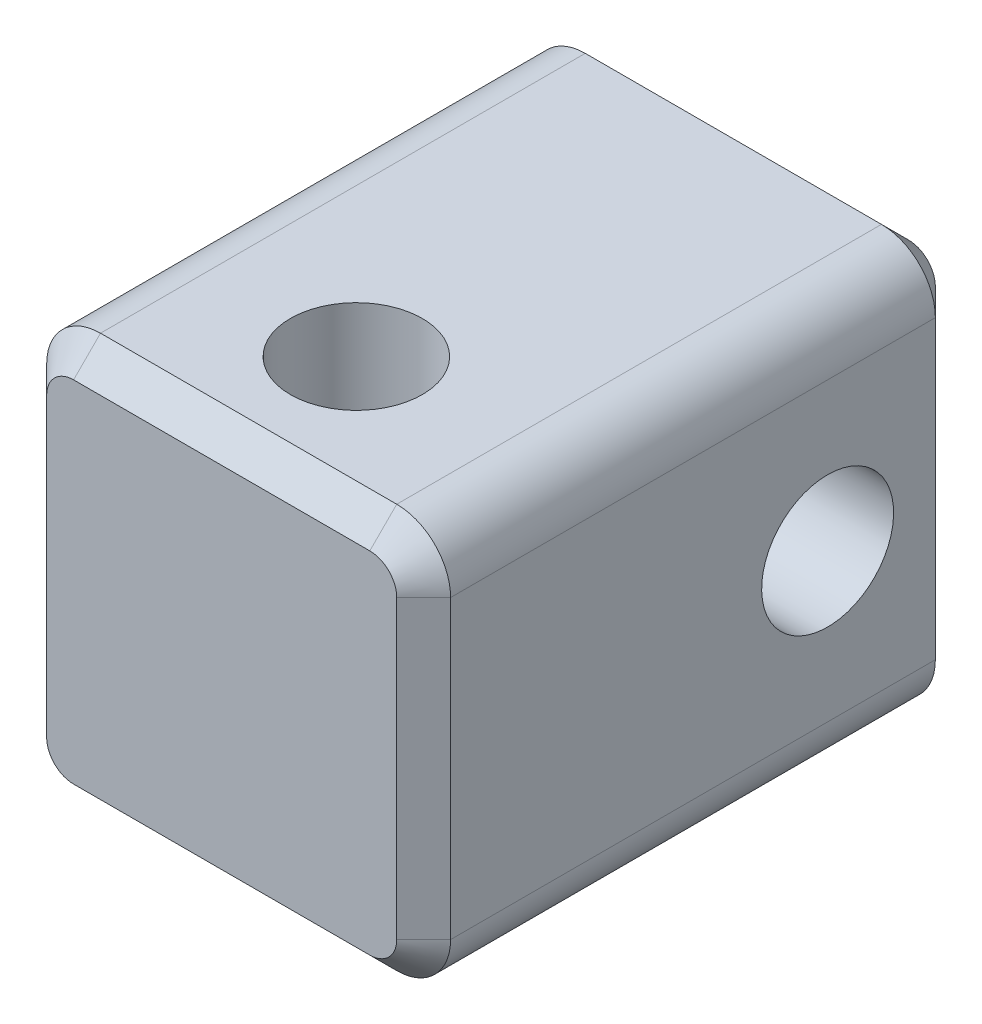
ISO-10303-21;
HEADER;
FILE_DESCRIPTION(('STEP AP214'),'2;1');
FILE_NAME('part.step','',(''),(''),'','','');
FILE_SCHEMA(('AUTOMOTIVE_DESIGN { 1 0 10303 214 1 1 1 1 }'));
ENDSEC;
DATA;
#1=APPLICATION_CONTEXT('core data for automotive mechanical design processes');
#2=APPLICATION_PROTOCOL_DEFINITION('international standard','automotive_design',2000,#1);
#3=PRODUCT_CONTEXT('',#1,'mechanical');
#4=PRODUCT('Part','Part','',(#3));
#5=PRODUCT_RELATED_PRODUCT_CATEGORY('part','',(#4));
#6=PRODUCT_DEFINITION_FORMATION('','',#4);
#7=PRODUCT_DEFINITION_CONTEXT('part definition',#1,'design');
#8=PRODUCT_DEFINITION('design','',#6,#7);
#9=PRODUCT_DEFINITION_SHAPE('','',#8);
#10=(LENGTH_UNIT() NAMED_UNIT(*) SI_UNIT(.MILLI.,.METRE.));
#11=(NAMED_UNIT(*) PLANE_ANGLE_UNIT() SI_UNIT($,.RADIAN.));
#12=(NAMED_UNIT(*) SI_UNIT($,.STERADIAN.) SOLID_ANGLE_UNIT());
#13=UNCERTAINTY_MEASURE_WITH_UNIT(LENGTH_MEASURE(1.E-05),#10,'distance_accuracy_value','');
#14=(GEOMETRIC_REPRESENTATION_CONTEXT(3) GLOBAL_UNCERTAINTY_ASSIGNED_CONTEXT((#13)) GLOBAL_UNIT_ASSIGNED_CONTEXT((#10,
#11,#12)) REPRESENTATION_CONTEXT('',''));
#15=CARTESIAN_POINT('',(0.,0.,0.));
#16=DIRECTION('',(0.,0.,1.));
#17=DIRECTION('',(1.,0.,0.));
#18=AXIS2_PLACEMENT_3D('',#15,#16,#17);
#19=CARTESIAN_POINT('',(7.5,7.5,20.));
#20=DIRECTION('',(-1.,0.,0.));
#21=DIRECTION('',(0.,-1.,0.));
#22=AXIS2_PLACEMENT_3D('',#19,#20,#21);
#23=PLANE('',#22);
#24=CARTESIAN_POINT('',(7.5,0.,5.));
#25=DIRECTION('',(1.,0.,0.));
#26=DIRECTION('',(0.,1.,0.));
#27=AXIS2_PLACEMENT_3D('',#24,#25,#26);
#28=CIRCLE('',#27,2.45);
#29=CARTESIAN_POINT('',(7.5,2.45,5.));
#30=VERTEX_POINT('',#29);
#31=EDGE_CURVE('E357',#30,#30,#28,.T.);
#32=ORIENTED_EDGE('',*,*,#31,.F.);
#33=EDGE_LOOP('',(#32));
#34=FACE_BOUND('',#33,.T.);
#35=DIRECTION('',(0.,0.,-1.));
#36=VECTOR('',#35,1.);
#37=CARTESIAN_POINT('',(7.5,5.5,20.));
#38=LINE('',#37,#36);
#39=CARTESIAN_POINT('',(7.5,5.5,0.999999999999997));
#40=VERTEX_POINT('',#39);
#41=CARTESIAN_POINT('',(7.5,5.5,19.));
#42=VERTEX_POINT('',#41);
#43=EDGE_CURVE('E290',#40,#42,#38,.F.);
#44=ORIENTED_EDGE('',*,*,#43,.T.);
#45=DIRECTION('',(0.,-1.,0.));
#46=VECTOR('',#45,1.);
#47=CARTESIAN_POINT('',(7.5,-5.5,19.));
#48=LINE('',#47,#46);
#49=CARTESIAN_POINT('',(7.5,-5.5,19.));
#50=VERTEX_POINT('',#49);
#51=EDGE_CURVE('E201',#42,#50,#48,.T.);
#52=ORIENTED_EDGE('',*,*,#51,.T.);
#53=DIRECTION('',(0.,0.,-1.));
#54=VECTOR('',#53,1.);
#55=CARTESIAN_POINT('',(7.5,-5.5,20.));
#56=LINE('',#55,#54);
#57=CARTESIAN_POINT('',(7.5,-5.5,0.999999999999997));
#58=VERTEX_POINT('',#57);
#59=EDGE_CURVE('E285',#50,#58,#56,.T.);
#60=ORIENTED_EDGE('',*,*,#59,.T.);
#61=DIRECTION('',(0.,1.,0.));
#62=VECTOR('',#61,1.);
#63=CARTESIAN_POINT('',(7.5,7.5,0.999999999999997));
#64=LINE('',#63,#62);
#65=EDGE_CURVE('E199',#58,#40,#64,.T.);
#66=ORIENTED_EDGE('',*,*,#65,.T.);
#67=EDGE_LOOP('',(#44,#52,#60,#66));
#68=FACE_BOUND('',#67,.T.);
#69=ADVANCED_FACE('F34',(#34,#68),#23,.F.);
#70=CARTESIAN_POINT('',(-7.5,7.5,20.));
#71=DIRECTION('',(0.,-1.,0.));
#72=DIRECTION('',(0.,0.,-1.));
#73=AXIS2_PLACEMENT_3D('',#70,#71,#72);
#74=PLANE('',#73);
#75=CARTESIAN_POINT('',(0.,7.5,15.));
#76=DIRECTION('',(0.,1.,0.));
#77=DIRECTION('',(0.,0.,1.));
#78=AXIS2_PLACEMENT_3D('',#75,#76,#77);
#79=CIRCLE('',#78,2.45);
#80=CARTESIAN_POINT('',(0.,7.5,17.45));
#81=VERTEX_POINT('',#80);
#82=EDGE_CURVE('E240',#81,#81,#79,.T.);
#83=ORIENTED_EDGE('',*,*,#82,.F.);
#84=EDGE_LOOP('',(#83));
#85=FACE_BOUND('',#84,.T.);
#86=DIRECTION('',(0.,0.,-1.));
#87=VECTOR('',#86,1.);
#88=CARTESIAN_POINT('',(-5.5,7.5,20.));
#89=LINE('',#88,#87);
#90=CARTESIAN_POINT('',(-5.5,7.5,0.999999999999997));
#91=VERTEX_POINT('',#90);
#92=CARTESIAN_POINT('',(-5.5,7.5,19.));
#93=VERTEX_POINT('',#92);
#94=EDGE_CURVE('E168',#91,#93,#89,.F.);
#95=ORIENTED_EDGE('',*,*,#94,.T.);
#96=DIRECTION('',(1.,0.,0.));
#97=VECTOR('',#96,1.);
#98=CARTESIAN_POINT('',(5.5,7.5,19.));
#99=LINE('',#98,#97);
#100=CARTESIAN_POINT('',(5.5,7.5,19.));
#101=VERTEX_POINT('',#100);
#102=EDGE_CURVE('E192',#93,#101,#99,.T.);
#103=ORIENTED_EDGE('',*,*,#102,.T.);
#104=DIRECTION('',(0.,0.,-1.));
#105=VECTOR('',#104,1.);
#106=CARTESIAN_POINT('',(5.5,7.5,20.));
#107=LINE('',#106,#105);
#108=CARTESIAN_POINT('',(5.5,7.5,0.999999999999997));
#109=VERTEX_POINT('',#108);
#110=EDGE_CURVE('E297',#101,#109,#107,.T.);
#111=ORIENTED_EDGE('',*,*,#110,.T.);
#112=DIRECTION('',(-1.,0.,0.));
#113=VECTOR('',#112,1.);
#114=CARTESIAN_POINT('',(-7.5,7.5,0.999999999999997));
#115=LINE('',#114,#113);
#116=EDGE_CURVE('E190',#109,#91,#115,.T.);
#117=ORIENTED_EDGE('',*,*,#116,.T.);
#118=EDGE_LOOP('',(#95,#103,#111,#117));
#119=FACE_BOUND('',#118,.T.);
#120=ADVANCED_FACE('F377',(#85,#119),#74,.F.);
#121=CARTESIAN_POINT('',(-7.5,7.5,20.));
#122=DIRECTION('',(1.,0.,0.));
#123=DIRECTION('',(0.,1.,0.));
#124=AXIS2_PLACEMENT_3D('',#121,#122,#123);
#125=PLANE('',#124);
#126=CARTESIAN_POINT('',(-7.5,0.,5.));
#127=DIRECTION('',(1.,0.,0.));
#128=DIRECTION('',(0.,1.,0.));
#129=AXIS2_PLACEMENT_3D('',#126,#127,#128);
#130=CIRCLE('',#129,2.45);
#131=CARTESIAN_POINT('',(-7.5,2.45,5.));
#132=VERTEX_POINT('',#131);
#133=EDGE_CURVE('E355',#132,#132,#130,.T.);
#134=ORIENTED_EDGE('',*,*,#133,.T.);
#135=EDGE_LOOP('',(#134));
#136=FACE_BOUND('',#135,.T.);
#137=DIRECTION('',(0.,0.,-1.));
#138=VECTOR('',#137,1.);
#139=CARTESIAN_POINT('',(-7.5,-5.5,20.));
#140=LINE('',#139,#138);
#141=CARTESIAN_POINT('',(-7.5,-5.5,0.999999999999997));
#142=VERTEX_POINT('',#141);
#143=CARTESIAN_POINT('',(-7.5,-5.5,19.));
#144=VERTEX_POINT('',#143);
#145=EDGE_CURVE('E279',#142,#144,#140,.F.);
#146=ORIENTED_EDGE('',*,*,#145,.T.);
#147=DIRECTION('',(0.,1.,0.));
#148=VECTOR('',#147,1.);
#149=CARTESIAN_POINT('',(-7.5,5.5,19.));
#150=LINE('',#149,#148);
#151=CARTESIAN_POINT('',(-7.5,5.5,19.));
#152=VERTEX_POINT('',#151);
#153=EDGE_CURVE('E184',#144,#152,#150,.T.);
#154=ORIENTED_EDGE('',*,*,#153,.T.);
#155=DIRECTION('',(0.,0.,-1.));
#156=VECTOR('',#155,1.);
#157=CARTESIAN_POINT('',(-7.5,5.5,20.));
#158=LINE('',#157,#156);
#159=CARTESIAN_POINT('',(-7.5,5.5,0.999999999999997));
#160=VERTEX_POINT('',#159);
#161=EDGE_CURVE('E287',#152,#160,#158,.T.);
#162=ORIENTED_EDGE('',*,*,#161,.T.);
#163=DIRECTION('',(0.,-1.,0.));
#164=VECTOR('',#163,1.);
#165=CARTESIAN_POINT('',(-7.5,7.5,0.999999999999997));
#166=LINE('',#165,#164);
#167=EDGE_CURVE('E182',#160,#142,#166,.T.);
#168=ORIENTED_EDGE('',*,*,#167,.T.);
#169=EDGE_LOOP('',(#146,#154,#162,#168));
#170=FACE_BOUND('',#169,.T.);
#171=ADVANCED_FACE('F320',(#136,#170),#125,.F.);
#172=CARTESIAN_POINT('',(-7.5,-7.5,20.));
#173=DIRECTION('',(0.,1.,0.));
#174=DIRECTION('',(0.,0.,1.));
#175=AXIS2_PLACEMENT_3D('',#172,#173,#174);
#176=PLANE('',#175);
#177=CARTESIAN_POINT('',(0.,-7.5,15.));
#178=DIRECTION('',(0.,1.,0.));
#179=DIRECTION('',(0.,0.,1.));
#180=AXIS2_PLACEMENT_3D('',#177,#178,#179);
#181=CIRCLE('',#180,2.45);
#182=CARTESIAN_POINT('',(0.,-7.5,17.45));
#183=VERTEX_POINT('',#182);
#184=EDGE_CURVE('E361',#183,#183,#181,.T.);
#185=ORIENTED_EDGE('',*,*,#184,.T.);
#186=EDGE_LOOP('',(#185));
#187=FACE_BOUND('',#186,.T.);
#188=DIRECTION('',(0.,0.,-1.));
#189=VECTOR('',#188,1.);
#190=CARTESIAN_POINT('',(5.5,-7.5,20.));
#191=LINE('',#190,#189);
#192=CARTESIAN_POINT('',(5.5,-7.5,0.999999999999997));
#193=VERTEX_POINT('',#192);
#194=CARTESIAN_POINT('',(5.5,-7.5,19.));
#195=VERTEX_POINT('',#194);
#196=EDGE_CURVE('E284',#193,#195,#191,.F.);
#197=ORIENTED_EDGE('',*,*,#196,.T.);
#198=DIRECTION('',(-1.,0.,0.));
#199=VECTOR('',#198,1.);
#200=CARTESIAN_POINT('',(-5.5,-7.5,19.));
#201=LINE('',#200,#199);
#202=CARTESIAN_POINT('',(-5.5,-7.5,19.));
#203=VERTEX_POINT('',#202);
#204=EDGE_CURVE('E209',#195,#203,#201,.T.);
#205=ORIENTED_EDGE('',*,*,#204,.T.);
#206=DIRECTION('',(0.,0.,-1.));
#207=VECTOR('',#206,1.);
#208=CARTESIAN_POINT('',(-5.5,-7.5,20.));
#209=LINE('',#208,#207);
#210=CARTESIAN_POINT('',(-5.5,-7.5,0.999999999999997));
#211=VERTEX_POINT('',#210);
#212=EDGE_CURVE('E277',#203,#211,#209,.T.);
#213=ORIENTED_EDGE('',*,*,#212,.T.);
#214=DIRECTION('',(1.,0.,0.));
#215=VECTOR('',#214,1.);
#216=CARTESIAN_POINT('',(-7.5,-7.5,0.999999999999997));
#217=LINE('',#216,#215);
#218=EDGE_CURVE('E207',#211,#193,#217,.T.);
#219=ORIENTED_EDGE('',*,*,#218,.T.);
#220=EDGE_LOOP('',(#197,#205,#213,#219));
#221=FACE_BOUND('',#220,.T.);
#222=ADVANCED_FACE('F282',(#187,#221),#176,.F.);
#223=CARTESIAN_POINT('',(0.,0.,20.));
#224=DIRECTION('',(0.,0.,1.));
#225=DIRECTION('',(1.,0.,0.));
#226=AXIS2_PLACEMENT_3D('',#223,#224,#225);
#227=PLANE('',#226);
#228=DIRECTION('',(0.,-1.,0.));
#229=VECTOR('',#228,1.);
#230=CARTESIAN_POINT('',(-6.50000000000001,-5.5,20.));
#231=LINE('',#230,#229);
#232=CARTESIAN_POINT('',(-6.50000000000001,5.5,20.));
#233=VERTEX_POINT('',#232);
#234=CARTESIAN_POINT('',(-6.50000000000001,-5.5,20.));
#235=VERTEX_POINT('',#234);
#236=EDGE_CURVE('E172',#233,#235,#231,.T.);
#237=ORIENTED_EDGE('',*,*,#236,.T.);
#238=CARTESIAN_POINT('',(-5.5,-5.5,20.));
#239=DIRECTION('',(0.,0.,1.));
#240=DIRECTION('',(1.,0.,0.));
#241=AXIS2_PLACEMENT_3D('',#238,#239,#240);
#242=CIRCLE('',#241,1.00000000000001);
#243=CARTESIAN_POINT('',(-5.5,-6.50000000000001,20.));
#244=VERTEX_POINT('',#243);
#245=EDGE_CURVE('E153',#235,#244,#242,.T.);
#246=ORIENTED_EDGE('',*,*,#245,.T.);
#247=DIRECTION('',(1.,0.,0.));
#248=VECTOR('',#247,1.);
#249=CARTESIAN_POINT('',(5.5,-6.50000000000001,20.));
#250=LINE('',#249,#248);
#251=CARTESIAN_POINT('',(5.5,-6.50000000000001,20.));
#252=VERTEX_POINT('',#251);
#253=EDGE_CURVE('E161',#244,#252,#250,.T.);
#254=ORIENTED_EDGE('',*,*,#253,.T.);
#255=CARTESIAN_POINT('',(5.5,-5.5,20.));
#256=DIRECTION('',(0.,0.,1.));
#257=DIRECTION('',(1.,0.,0.));
#258=AXIS2_PLACEMENT_3D('',#255,#256,#257);
#259=CIRCLE('',#258,1.00000000000001);
#260=CARTESIAN_POINT('',(6.50000000000001,-5.5,20.));
#261=VERTEX_POINT('',#260);
#262=EDGE_CURVE('E167',#252,#261,#259,.T.);
#263=ORIENTED_EDGE('',*,*,#262,.T.);
#264=DIRECTION('',(0.,1.,0.));
#265=VECTOR('',#264,1.);
#266=CARTESIAN_POINT('',(6.5,5.5,20.));
#267=LINE('',#266,#265);
#268=CARTESIAN_POINT('',(6.5,5.5,20.));
#269=VERTEX_POINT('',#268);
#270=EDGE_CURVE('E303',#261,#269,#267,.T.);
#271=ORIENTED_EDGE('',*,*,#270,.T.);
#272=CARTESIAN_POINT('',(5.5,5.5,20.));
#273=DIRECTION('',(0.,0.,1.));
#274=DIRECTION('',(1.,0.,0.));
#275=AXIS2_PLACEMENT_3D('',#272,#273,#274);
#276=CIRCLE('',#275,1.00000000000001);
#277=CARTESIAN_POINT('',(5.5,6.5,20.));
#278=VERTEX_POINT('',#277);
#279=EDGE_CURVE('E305',#269,#278,#276,.T.);
#280=ORIENTED_EDGE('',*,*,#279,.T.);
#281=DIRECTION('',(-1.,0.,0.));
#282=VECTOR('',#281,1.);
#283=CARTESIAN_POINT('',(-5.5,6.5,20.));
#284=LINE('',#283,#282);
#285=CARTESIAN_POINT('',(-5.5,6.5,20.));
#286=VERTEX_POINT('',#285);
#287=EDGE_CURVE('E307',#278,#286,#284,.T.);
#288=ORIENTED_EDGE('',*,*,#287,.T.);
#289=CARTESIAN_POINT('',(-5.5,5.5,20.));
#290=DIRECTION('',(0.,0.,1.));
#291=DIRECTION('',(1.,0.,0.));
#292=AXIS2_PLACEMENT_3D('',#289,#290,#291);
#293=CIRCLE('',#292,1.00000000000001);
#294=EDGE_CURVE('E177',#286,#233,#293,.T.);
#295=ORIENTED_EDGE('',*,*,#294,.T.);
#296=EDGE_LOOP('',(#237,#246,#254,#263,#271,#280,#288,#295));
#297=FACE_BOUND('',#296,.T.);
#298=ADVANCED_FACE('F170',(#297),#227,.T.);
#299=CARTESIAN_POINT('',(0.,0.,0.));
#300=DIRECTION('',(0.,0.,1.));
#301=DIRECTION('',(1.,0.,0.));
#302=AXIS2_PLACEMENT_3D('',#299,#300,#301);
#303=PLANE('',#302);
#304=DIRECTION('',(1.,0.,0.));
#305=VECTOR('',#304,1.);
#306=CARTESIAN_POINT('',(0.,6.5,0.));
#307=LINE('',#306,#305);
#308=CARTESIAN_POINT('',(-5.5,6.5,0.));
#309=VERTEX_POINT('',#308);
#310=CARTESIAN_POINT('',(5.5,6.5,0.));
#311=VERTEX_POINT('',#310);
#312=EDGE_CURVE('E44',#309,#311,#307,.T.);
#313=ORIENTED_EDGE('',*,*,#312,.T.);
#314=CARTESIAN_POINT('',(5.5,5.5,0.));
#315=DIRECTION('',(0.,0.,1.));
#316=DIRECTION('',(1.,0.,0.));
#317=AXIS2_PLACEMENT_3D('',#314,#315,#316);
#318=CIRCLE('',#317,0.999999999999999);
#319=CARTESIAN_POINT('',(6.5,5.5,0.));
#320=VERTEX_POINT('',#319);
#321=EDGE_CURVE('E11',#311,#320,#318,.F.);
#322=ORIENTED_EDGE('',*,*,#321,.T.);
#323=DIRECTION('',(0.,-1.,0.));
#324=VECTOR('',#323,1.);
#325=CARTESIAN_POINT('',(6.5,0.,0.));
#326=LINE('',#325,#324);
#327=CARTESIAN_POINT('',(6.5,-5.5,0.));
#328=VERTEX_POINT('',#327);
#329=EDGE_CURVE('E211',#320,#328,#326,.T.);
#330=ORIENTED_EDGE('',*,*,#329,.T.);
#331=CARTESIAN_POINT('',(5.5,-5.5,0.));
#332=DIRECTION('',(0.,0.,1.));
#333=DIRECTION('',(1.,0.,0.));
#334=AXIS2_PLACEMENT_3D('',#331,#332,#333);
#335=CIRCLE('',#334,0.999999999999999);
#336=CARTESIAN_POINT('',(5.5,-6.5,0.));
#337=VERTEX_POINT('',#336);
#338=EDGE_CURVE('E213',#328,#337,#335,.F.);
#339=ORIENTED_EDGE('',*,*,#338,.T.);
#340=DIRECTION('',(-1.,0.,0.));
#341=VECTOR('',#340,1.);
#342=CARTESIAN_POINT('',(0.,-6.5,0.));
#343=LINE('',#342,#341);
#344=CARTESIAN_POINT('',(-5.5,-6.5,0.));
#345=VERTEX_POINT('',#344);
#346=EDGE_CURVE('E215',#337,#345,#343,.T.);
#347=ORIENTED_EDGE('',*,*,#346,.T.);
#348=CARTESIAN_POINT('',(-5.5,-5.5,0.));
#349=DIRECTION('',(0.,0.,1.));
#350=DIRECTION('',(1.,0.,0.));
#351=AXIS2_PLACEMENT_3D('',#348,#349,#350);
#352=CIRCLE('',#351,0.999999999999999);
#353=CARTESIAN_POINT('',(-6.5,-5.5,0.));
#354=VERTEX_POINT('',#353);
#355=EDGE_CURVE('E217',#345,#354,#352,.F.);
#356=ORIENTED_EDGE('',*,*,#355,.T.);
#357=DIRECTION('',(0.,1.,0.));
#358=VECTOR('',#357,1.);
#359=CARTESIAN_POINT('',(-6.5,0.,0.));
#360=LINE('',#359,#358);
#361=CARTESIAN_POINT('',(-6.5,5.5,0.));
#362=VERTEX_POINT('',#361);
#363=EDGE_CURVE('E219',#354,#362,#360,.T.);
#364=ORIENTED_EDGE('',*,*,#363,.T.);
#365=CARTESIAN_POINT('',(-5.5,5.5,0.));
#366=DIRECTION('',(0.,0.,1.));
#367=DIRECTION('',(1.,0.,0.));
#368=AXIS2_PLACEMENT_3D('',#365,#366,#367);
#369=CIRCLE('',#368,0.999999999999999);
#370=EDGE_CURVE('E55',#362,#309,#369,.F.);
#371=ORIENTED_EDGE('',*,*,#370,.T.);
#372=EDGE_LOOP('',(#313,#322,#330,#339,#347,#356,#364,#371));
#373=FACE_BOUND('',#372,.T.);
#374=ADVANCED_FACE('F336',(#373),#303,.F.);
#375=CARTESIAN_POINT('',(-7.5,0.,5.));
#376=DIRECTION('',(1.,0.,0.));
#377=DIRECTION('',(0.,1.,0.));
#378=AXIS2_PLACEMENT_3D('',#375,#376,#377);
#379=CYLINDRICAL_SURFACE('',#378,2.45);
#380=ORIENTED_EDGE('',*,*,#133,.F.);
#381=EDGE_LOOP('',(#380));
#382=FACE_BOUND('',#381,.T.);
#383=ORIENTED_EDGE('',*,*,#31,.T.);
#384=EDGE_LOOP('',(#383));
#385=FACE_BOUND('',#384,.T.);
#386=ADVANCED_FACE('F373',(#382,#385),#379,.F.);
#387=CARTESIAN_POINT('',(0.,-7.5,15.));
#388=DIRECTION('',(0.,1.,0.));
#389=DIRECTION('',(0.,0.,1.));
#390=AXIS2_PLACEMENT_3D('',#387,#388,#389);
#391=CYLINDRICAL_SURFACE('',#390,2.45);
#392=ORIENTED_EDGE('',*,*,#184,.F.);
#393=EDGE_LOOP('',(#392));
#394=FACE_BOUND('',#393,.T.);
#395=ORIENTED_EDGE('',*,*,#82,.T.);
#396=EDGE_LOOP('',(#395));
#397=FACE_BOUND('',#396,.T.);
#398=ADVANCED_FACE('F369',(#394,#397),#391,.F.);
#399=CARTESIAN_POINT('',(5.5,-5.5,20.));
#400=DIRECTION('',(0.,0.,-1.));
#401=DIRECTION('',(-1.,0.,0.));
#402=AXIS2_PLACEMENT_3D('',#399,#400,#401);
#403=CYLINDRICAL_SURFACE('',#402,2.);
#404=ORIENTED_EDGE('',*,*,#59,.F.);
#405=CARTESIAN_POINT('',(5.5,-5.5,19.));
#406=DIRECTION('',(0.,0.,1.));
#407=DIRECTION('',(1.,0.,0.));
#408=AXIS2_PLACEMENT_3D('',#405,#406,#407);
#409=CIRCLE('',#408,2.);
#410=EDGE_CURVE('E205',#50,#195,#409,.F.);
#411=ORIENTED_EDGE('',*,*,#410,.T.);
#412=ORIENTED_EDGE('',*,*,#196,.F.);
#413=CARTESIAN_POINT('',(5.5,-5.5,0.999999999999997));
#414=DIRECTION('',(0.,0.,1.));
#415=DIRECTION('',(1.,0.,0.));
#416=AXIS2_PLACEMENT_3D('',#413,#414,#415);
#417=CIRCLE('',#416,2.);
#418=EDGE_CURVE('E203',#193,#58,#417,.T.);
#419=ORIENTED_EDGE('',*,*,#418,.T.);
#420=EDGE_LOOP('',(#404,#411,#412,#419));
#421=FACE_BOUND('',#420,.T.);
#422=ADVANCED_FACE('F372',(#421),#403,.T.);
#423=CARTESIAN_POINT('',(-5.5,-5.5,20.));
#424=DIRECTION('',(0.,0.,-1.));
#425=DIRECTION('',(-1.,0.,0.));
#426=AXIS2_PLACEMENT_3D('',#423,#424,#425);
#427=CYLINDRICAL_SURFACE('',#426,2.);
#428=ORIENTED_EDGE('',*,*,#212,.F.);
#429=CARTESIAN_POINT('',(-5.5,-5.5,19.));
#430=DIRECTION('',(0.,0.,1.));
#431=DIRECTION('',(1.,0.,0.));
#432=AXIS2_PLACEMENT_3D('',#429,#430,#431);
#433=CIRCLE('',#432,2.);
#434=EDGE_CURVE('E155',#203,#144,#433,.F.);
#435=ORIENTED_EDGE('',*,*,#434,.T.);
#436=ORIENTED_EDGE('',*,*,#145,.F.);
#437=CARTESIAN_POINT('',(-5.5,-5.5,0.999999999999997));
#438=DIRECTION('',(0.,0.,1.));
#439=DIRECTION('',(1.,0.,0.));
#440=AXIS2_PLACEMENT_3D('',#437,#438,#439);
#441=CIRCLE('',#440,2.);
#442=EDGE_CURVE('E174',#142,#211,#441,.T.);
#443=ORIENTED_EDGE('',*,*,#442,.T.);
#444=EDGE_LOOP('',(#428,#435,#436,#443));
#445=FACE_BOUND('',#444,.T.);
#446=ADVANCED_FACE('F276',(#445),#427,.T.);
#447=CARTESIAN_POINT('',(-5.5,5.5,20.));
#448=DIRECTION('',(0.,0.,-1.));
#449=DIRECTION('',(-1.,0.,0.));
#450=AXIS2_PLACEMENT_3D('',#447,#448,#449);
#451=CYLINDRICAL_SURFACE('',#450,2.);
#452=ORIENTED_EDGE('',*,*,#161,.F.);
#453=CARTESIAN_POINT('',(-5.5,5.5,19.));
#454=DIRECTION('',(0.,0.,1.));
#455=DIRECTION('',(1.,0.,0.));
#456=AXIS2_PLACEMENT_3D('',#453,#454,#455);
#457=CIRCLE('',#456,2.);
#458=EDGE_CURVE('E188',#152,#93,#457,.F.);
#459=ORIENTED_EDGE('',*,*,#458,.T.);
#460=ORIENTED_EDGE('',*,*,#94,.F.);
#461=CARTESIAN_POINT('',(-5.5,5.5,0.999999999999997));
#462=DIRECTION('',(0.,0.,1.));
#463=DIRECTION('',(1.,0.,0.));
#464=AXIS2_PLACEMENT_3D('',#461,#462,#463);
#465=CIRCLE('',#464,2.);
#466=EDGE_CURVE('E186',#91,#160,#465,.T.);
#467=ORIENTED_EDGE('',*,*,#466,.T.);
#468=EDGE_LOOP('',(#452,#459,#460,#467));
#469=FACE_BOUND('',#468,.T.);
#470=ADVANCED_FACE('F322',(#469),#451,.T.);
#471=CARTESIAN_POINT('',(5.5,5.5,20.));
#472=DIRECTION('',(0.,0.,-1.));
#473=DIRECTION('',(-1.,0.,0.));
#474=AXIS2_PLACEMENT_3D('',#471,#472,#473);
#475=CYLINDRICAL_SURFACE('',#474,2.);
#476=ORIENTED_EDGE('',*,*,#110,.F.);
#477=CARTESIAN_POINT('',(5.5,5.5,19.));
#478=DIRECTION('',(0.,0.,1.));
#479=DIRECTION('',(1.,0.,0.));
#480=AXIS2_PLACEMENT_3D('',#477,#478,#479);
#481=CIRCLE('',#480,2.);
#482=EDGE_CURVE('E197',#101,#42,#481,.F.);
#483=ORIENTED_EDGE('',*,*,#482,.T.);
#484=ORIENTED_EDGE('',*,*,#43,.F.);
#485=CARTESIAN_POINT('',(5.5,5.5,0.999999999999997));
#486=DIRECTION('',(0.,0.,1.));
#487=DIRECTION('',(1.,0.,0.));
#488=AXIS2_PLACEMENT_3D('',#485,#486,#487);
#489=CIRCLE('',#488,2.);
#490=EDGE_CURVE('E194',#40,#109,#489,.T.);
#491=ORIENTED_EDGE('',*,*,#490,.T.);
#492=EDGE_LOOP('',(#476,#483,#484,#491));
#493=FACE_BOUND('',#492,.T.);
#494=ADVANCED_FACE('F353',(#493),#475,.T.);
#495=CARTESIAN_POINT('',(5.5,5.5,20.));
#496=DIRECTION('',(0.,0.,-1.));
#497=DIRECTION('',(-1.,0.,0.));
#498=AXIS2_PLACEMENT_3D('',#495,#496,#497);
#499=CONICAL_SURFACE('',#498,1.00000000000001,0.785398163397445);
#500=DIRECTION('',(-0.707106781186545,0.,0.70710678118655));
#501=VECTOR('',#500,1.);
#502=CARTESIAN_POINT('',(7.5,5.5,19.));
#503=LINE('',#502,#501);
#504=EDGE_CURVE('E234',#42,#269,#503,.T.);
#505=ORIENTED_EDGE('',*,*,#504,.F.);
#506=ORIENTED_EDGE('',*,*,#482,.F.);
#507=DIRECTION('',(0.,0.707106781186545,-0.70710678118655));
#508=VECTOR('',#507,1.);
#509=CARTESIAN_POINT('',(5.5,6.5,20.));
#510=LINE('',#509,#508);
#511=EDGE_CURVE('E237',#278,#101,#510,.T.);
#512=ORIENTED_EDGE('',*,*,#511,.F.);
#513=ORIENTED_EDGE('',*,*,#279,.F.);
#514=EDGE_LOOP('',(#505,#506,#512,#513));
#515=FACE_BOUND('',#514,.T.);
#516=ADVANCED_FACE('F387',(#515),#499,.T.);
#517=CARTESIAN_POINT('',(0.,6.5,20.));
#518=DIRECTION('',(0.,0.70710678118655,0.707106781186545));
#519=DIRECTION('',(1.,0.,0.));
#520=AXIS2_PLACEMENT_3D('',#517,#518,#519);
#521=PLANE('',#520);
#522=ORIENTED_EDGE('',*,*,#511,.T.);
#523=ORIENTED_EDGE('',*,*,#102,.F.);
#524=DIRECTION('',(0.,0.707106781186545,-0.70710678118655));
#525=VECTOR('',#524,1.);
#526=CARTESIAN_POINT('',(-5.5,6.5,20.));
#527=LINE('',#526,#525);
#528=EDGE_CURVE('E231',#286,#93,#527,.T.);
#529=ORIENTED_EDGE('',*,*,#528,.F.);
#530=ORIENTED_EDGE('',*,*,#287,.F.);
#531=EDGE_LOOP('',(#522,#523,#529,#530));
#532=FACE_BOUND('',#531,.T.);
#533=ADVANCED_FACE('F383',(#532),#521,.T.);
#534=CARTESIAN_POINT('',(6.5,0.,20.));
#535=DIRECTION('',(0.70710678118655,0.,0.707106781186545));
#536=DIRECTION('',(0.,-1.,0.));
#537=AXIS2_PLACEMENT_3D('',#534,#535,#536);
#538=PLANE('',#537);
#539=ORIENTED_EDGE('',*,*,#504,.T.);
#540=ORIENTED_EDGE('',*,*,#270,.F.);
#541=DIRECTION('',(-0.707106781186545,0.,0.70710678118655));
#542=VECTOR('',#541,1.);
#543=CARTESIAN_POINT('',(7.5,-5.5,19.));
#544=LINE('',#543,#542);
#545=EDGE_CURVE('E228',#50,#261,#544,.T.);
#546=ORIENTED_EDGE('',*,*,#545,.F.);
#547=ORIENTED_EDGE('',*,*,#51,.F.);
#548=EDGE_LOOP('',(#539,#540,#546,#547));
#549=FACE_BOUND('',#548,.T.);
#550=ADVANCED_FACE('F392',(#549),#538,.T.);
#551=CARTESIAN_POINT('',(-5.5,5.5,20.));
#552=DIRECTION('',(0.,0.,-1.));
#553=DIRECTION('',(-1.,0.,0.));
#554=AXIS2_PLACEMENT_3D('',#551,#552,#553);
#555=CONICAL_SURFACE('',#554,1.00000000000001,0.785398163397445);
#556=ORIENTED_EDGE('',*,*,#528,.T.);
#557=ORIENTED_EDGE('',*,*,#458,.F.);
#558=DIRECTION('',(-0.707106781186545,0.,-0.70710678118655));
#559=VECTOR('',#558,1.);
#560=CARTESIAN_POINT('',(-6.50000000000001,5.5,20.));
#561=LINE('',#560,#559);
#562=EDGE_CURVE('E225',#233,#152,#561,.T.);
#563=ORIENTED_EDGE('',*,*,#562,.F.);
#564=ORIENTED_EDGE('',*,*,#294,.F.);
#565=EDGE_LOOP('',(#556,#557,#563,#564));
#566=FACE_BOUND('',#565,.T.);
#567=ADVANCED_FACE('F314',(#566),#555,.T.);
#568=CARTESIAN_POINT('',(5.5,-5.5,20.));
#569=DIRECTION('',(0.,0.,-1.));
#570=DIRECTION('',(-1.,0.,0.));
#571=AXIS2_PLACEMENT_3D('',#568,#569,#570);
#572=CONICAL_SURFACE('',#571,1.00000000000001,0.785398163397445);
#573=ORIENTED_EDGE('',*,*,#545,.T.);
#574=ORIENTED_EDGE('',*,*,#262,.F.);
#575=DIRECTION('',(0.,0.707106781186545,0.70710678118655));
#576=VECTOR('',#575,1.);
#577=CARTESIAN_POINT('',(5.5,-7.5,19.));
#578=LINE('',#577,#576);
#579=EDGE_CURVE('E164',#195,#252,#578,.T.);
#580=ORIENTED_EDGE('',*,*,#579,.F.);
#581=ORIENTED_EDGE('',*,*,#410,.F.);
#582=EDGE_LOOP('',(#573,#574,#580,#581));
#583=FACE_BOUND('',#582,.T.);
#584=ADVANCED_FACE('F436',(#583),#572,.T.);
#585=CARTESIAN_POINT('',(-6.50000000000001,0.,20.));
#586=DIRECTION('',(-0.70710678118655,0.,0.707106781186545));
#587=DIRECTION('',(0.,1.,0.));
#588=AXIS2_PLACEMENT_3D('',#585,#586,#587);
#589=PLANE('',#588);
#590=ORIENTED_EDGE('',*,*,#562,.T.);
#591=ORIENTED_EDGE('',*,*,#153,.F.);
#592=DIRECTION('',(-0.707106781186545,0.,-0.70710678118655));
#593=VECTOR('',#592,1.);
#594=CARTESIAN_POINT('',(-6.50000000000001,-5.5,20.));
#595=LINE('',#594,#593);
#596=EDGE_CURVE('E158',#235,#144,#595,.T.);
#597=ORIENTED_EDGE('',*,*,#596,.F.);
#598=ORIENTED_EDGE('',*,*,#236,.F.);
#599=EDGE_LOOP('',(#590,#591,#597,#598));
#600=FACE_BOUND('',#599,.T.);
#601=ADVANCED_FACE('F317',(#600),#589,.T.);
#602=CARTESIAN_POINT('',(0.,-6.50000000000001,20.));
#603=DIRECTION('',(0.,-0.70710678118655,0.707106781186545));
#604=DIRECTION('',(-1.,0.,0.));
#605=AXIS2_PLACEMENT_3D('',#602,#603,#604);
#606=PLANE('',#605);
#607=ORIENTED_EDGE('',*,*,#579,.T.);
#608=ORIENTED_EDGE('',*,*,#253,.F.);
#609=DIRECTION('',(0.,0.707106781186545,0.70710678118655));
#610=VECTOR('',#609,1.);
#611=CARTESIAN_POINT('',(-5.5,-7.5,19.));
#612=LINE('',#611,#610);
#613=EDGE_CURVE('E149',#203,#244,#612,.T.);
#614=ORIENTED_EDGE('',*,*,#613,.F.);
#615=ORIENTED_EDGE('',*,*,#204,.F.);
#616=EDGE_LOOP('',(#607,#608,#614,#615));
#617=FACE_BOUND('',#616,.T.);
#618=ADVANCED_FACE('F162',(#617),#606,.T.);
#619=CARTESIAN_POINT('',(-5.5,-5.5,20.));
#620=DIRECTION('',(0.,0.,-1.));
#621=DIRECTION('',(-1.,0.,0.));
#622=AXIS2_PLACEMENT_3D('',#619,#620,#621);
#623=CONICAL_SURFACE('',#622,1.00000000000001,0.785398163397445);
#624=ORIENTED_EDGE('',*,*,#596,.T.);
#625=ORIENTED_EDGE('',*,*,#434,.F.);
#626=ORIENTED_EDGE('',*,*,#613,.T.);
#627=ORIENTED_EDGE('',*,*,#245,.F.);
#628=EDGE_LOOP('',(#624,#625,#626,#627));
#629=FACE_BOUND('',#628,.T.);
#630=ADVANCED_FACE('F151',(#629),#623,.T.);
#631=CARTESIAN_POINT('',(-5.5,-5.5,0.));
#632=DIRECTION('',(0.,0.,1.));
#633=DIRECTION('',(1.,0.,0.));
#634=AXIS2_PLACEMENT_3D('',#631,#632,#633);
#635=CONICAL_SURFACE('',#634,0.999999999999999,0.78539816339745);
#636=DIRECTION('',(0.,0.707106781186549,-0.707106781186546));
#637=VECTOR('',#636,1.);
#638=CARTESIAN_POINT('',(-5.5,-7.5,0.999999999999997));
#639=LINE('',#638,#637);
#640=EDGE_CURVE('E256',#211,#345,#639,.T.);
#641=ORIENTED_EDGE('',*,*,#640,.F.);
#642=ORIENTED_EDGE('',*,*,#442,.F.);
#643=DIRECTION('',(-0.707106781186549,0.,0.707106781186546));
#644=VECTOR('',#643,1.);
#645=CARTESIAN_POINT('',(-6.5,-5.5,0.));
#646=LINE('',#645,#644);
#647=EDGE_CURVE('E39',#354,#142,#646,.T.);
#648=ORIENTED_EDGE('',*,*,#647,.F.);
#649=ORIENTED_EDGE('',*,*,#355,.F.);
#650=EDGE_LOOP('',(#641,#642,#648,#649));
#651=FACE_BOUND('',#650,.T.);
#652=ADVANCED_FACE('F37',(#651),#635,.T.);
#653=CARTESIAN_POINT('',(-7.5,7.5,0.999999999999997));
#654=DIRECTION('',(0.707106781186546,0.,0.707106781186549));
#655=DIRECTION('',(0.,-1.,0.));
#656=AXIS2_PLACEMENT_3D('',#653,#654,#655);
#657=PLANE('',#656);
#658=ORIENTED_EDGE('',*,*,#647,.T.);
#659=ORIENTED_EDGE('',*,*,#167,.F.);
#660=DIRECTION('',(-0.707106781186549,0.,0.707106781186546));
#661=VECTOR('',#660,1.);
#662=CARTESIAN_POINT('',(-6.5,5.5,0.));
#663=LINE('',#662,#661);
#664=EDGE_CURVE('E254',#362,#160,#663,.T.);
#665=ORIENTED_EDGE('',*,*,#664,.F.);
#666=ORIENTED_EDGE('',*,*,#363,.F.);
#667=EDGE_LOOP('',(#658,#659,#665,#666));
#668=FACE_BOUND('',#667,.T.);
#669=ADVANCED_FACE('F267',(#668),#657,.F.);
#670=CARTESIAN_POINT('',(-7.5,-7.5,0.999999999999997));
#671=DIRECTION('',(0.,0.707106781186546,0.707106781186549));
#672=DIRECTION('',(1.,0.,0.));
#673=AXIS2_PLACEMENT_3D('',#670,#671,#672);
#674=PLANE('',#673);
#675=ORIENTED_EDGE('',*,*,#640,.T.);
#676=ORIENTED_EDGE('',*,*,#346,.F.);
#677=DIRECTION('',(0.,0.707106781186549,-0.707106781186546));
#678=VECTOR('',#677,1.);
#679=CARTESIAN_POINT('',(5.5,-7.5,0.999999999999997));
#680=LINE('',#679,#678);
#681=EDGE_CURVE('E251',#193,#337,#680,.T.);
#682=ORIENTED_EDGE('',*,*,#681,.F.);
#683=ORIENTED_EDGE('',*,*,#218,.F.);
#684=EDGE_LOOP('',(#675,#676,#682,#683));
#685=FACE_BOUND('',#684,.T.);
#686=ADVANCED_FACE('F395',(#685),#674,.F.);
#687=CARTESIAN_POINT('',(-5.5,5.5,0.));
#688=DIRECTION('',(0.,0.,1.));
#689=DIRECTION('',(1.,0.,0.));
#690=AXIS2_PLACEMENT_3D('',#687,#688,#689);
#691=CONICAL_SURFACE('',#690,0.999999999999999,0.78539816339745);
#692=ORIENTED_EDGE('',*,*,#664,.T.);
#693=ORIENTED_EDGE('',*,*,#466,.F.);
#694=DIRECTION('',(0.,0.707106781186549,0.707106781186546));
#695=VECTOR('',#694,1.);
#696=CARTESIAN_POINT('',(-5.5,6.5,0.));
#697=LINE('',#696,#695);
#698=EDGE_CURVE('E248',#309,#91,#697,.T.);
#699=ORIENTED_EDGE('',*,*,#698,.F.);
#700=ORIENTED_EDGE('',*,*,#370,.F.);
#701=EDGE_LOOP('',(#692,#693,#699,#700));
#702=FACE_BOUND('',#701,.T.);
#703=ADVANCED_FACE('F326',(#702),#691,.T.);
#704=CARTESIAN_POINT('',(5.5,-5.5,0.));
#705=DIRECTION('',(0.,0.,1.));
#706=DIRECTION('',(1.,0.,0.));
#707=AXIS2_PLACEMENT_3D('',#704,#705,#706);
#708=CONICAL_SURFACE('',#707,0.999999999999999,0.78539816339745);
#709=ORIENTED_EDGE('',*,*,#681,.T.);
#710=ORIENTED_EDGE('',*,*,#338,.F.);
#711=DIRECTION('',(-0.707106781186549,0.,-0.707106781186546));
#712=VECTOR('',#711,1.);
#713=CARTESIAN_POINT('',(7.5,-5.5,0.999999999999997));
#714=LINE('',#713,#712);
#715=EDGE_CURVE('E245',#58,#328,#714,.T.);
#716=ORIENTED_EDGE('',*,*,#715,.F.);
#717=ORIENTED_EDGE('',*,*,#418,.F.);
#718=EDGE_LOOP('',(#709,#710,#716,#717));
#719=FACE_BOUND('',#718,.T.);
#720=ADVANCED_FACE('F341',(#719),#708,.T.);
#721=CARTESIAN_POINT('',(-7.5,7.5,0.999999999999997));
#722=DIRECTION('',(0.,-0.707106781186546,0.707106781186549));
#723=DIRECTION('',(-1.,0.,0.));
#724=AXIS2_PLACEMENT_3D('',#721,#722,#723);
#725=PLANE('',#724);
#726=ORIENTED_EDGE('',*,*,#698,.T.);
#727=ORIENTED_EDGE('',*,*,#116,.F.);
#728=DIRECTION('',(0.,0.707106781186549,0.707106781186546));
#729=VECTOR('',#728,1.);
#730=CARTESIAN_POINT('',(5.5,6.5,0.));
#731=LINE('',#730,#729);
#732=EDGE_CURVE('E243',#311,#109,#731,.T.);
#733=ORIENTED_EDGE('',*,*,#732,.F.);
#734=ORIENTED_EDGE('',*,*,#312,.F.);
#735=EDGE_LOOP('',(#726,#727,#733,#734));
#736=FACE_BOUND('',#735,.T.);
#737=ADVANCED_FACE('F329',(#736),#725,.F.);
#738=CARTESIAN_POINT('',(7.5,7.5,0.999999999999997));
#739=DIRECTION('',(-0.707106781186546,0.,0.707106781186549));
#740=DIRECTION('',(0.,1.,0.));
#741=AXIS2_PLACEMENT_3D('',#738,#739,#740);
#742=PLANE('',#741);
#743=ORIENTED_EDGE('',*,*,#715,.T.);
#744=ORIENTED_EDGE('',*,*,#329,.F.);
#745=DIRECTION('',(-0.707106781186549,0.,-0.707106781186546));
#746=VECTOR('',#745,1.);
#747=CARTESIAN_POINT('',(7.5,5.5,0.999999999999997));
#748=LINE('',#747,#746);
#749=EDGE_CURVE('E241',#40,#320,#748,.T.);
#750=ORIENTED_EDGE('',*,*,#749,.F.);
#751=ORIENTED_EDGE('',*,*,#65,.F.);
#752=EDGE_LOOP('',(#743,#744,#750,#751));
#753=FACE_BOUND('',#752,.T.);
#754=ADVANCED_FACE('F345',(#753),#742,.F.);
#755=CARTESIAN_POINT('',(5.5,5.5,0.));
#756=DIRECTION('',(0.,0.,1.));
#757=DIRECTION('',(1.,0.,0.));
#758=AXIS2_PLACEMENT_3D('',#755,#756,#757);
#759=CONICAL_SURFACE('',#758,0.999999999999999,0.78539816339745);
#760=ORIENTED_EDGE('',*,*,#732,.T.);
#761=ORIENTED_EDGE('',*,*,#490,.F.);
#762=ORIENTED_EDGE('',*,*,#749,.T.);
#763=ORIENTED_EDGE('',*,*,#321,.F.);
#764=EDGE_LOOP('',(#760,#761,#762,#763));
#765=FACE_BOUND('',#764,.T.);
#766=ADVANCED_FACE('F333',(#765),#759,.T.);
#767=CLOSED_SHELL('',(#69,#120,#171,#222,#298,#374,#386,#398,#422,#446,#470,#494,#516,#533,#550,
#567,#584,#601,#618,#630,#652,#669,#686,#703,#720,#737,#754,#766));
#768=MANIFOLD_SOLID_BREP('B2',#767);
#769=ADVANCED_BREP_SHAPE_REPRESENTATION('',(#18,#768),#14);
#770=SHAPE_DEFINITION_REPRESENTATION(#9,#769);
ENDSEC;
END-ISO-10303-21;
